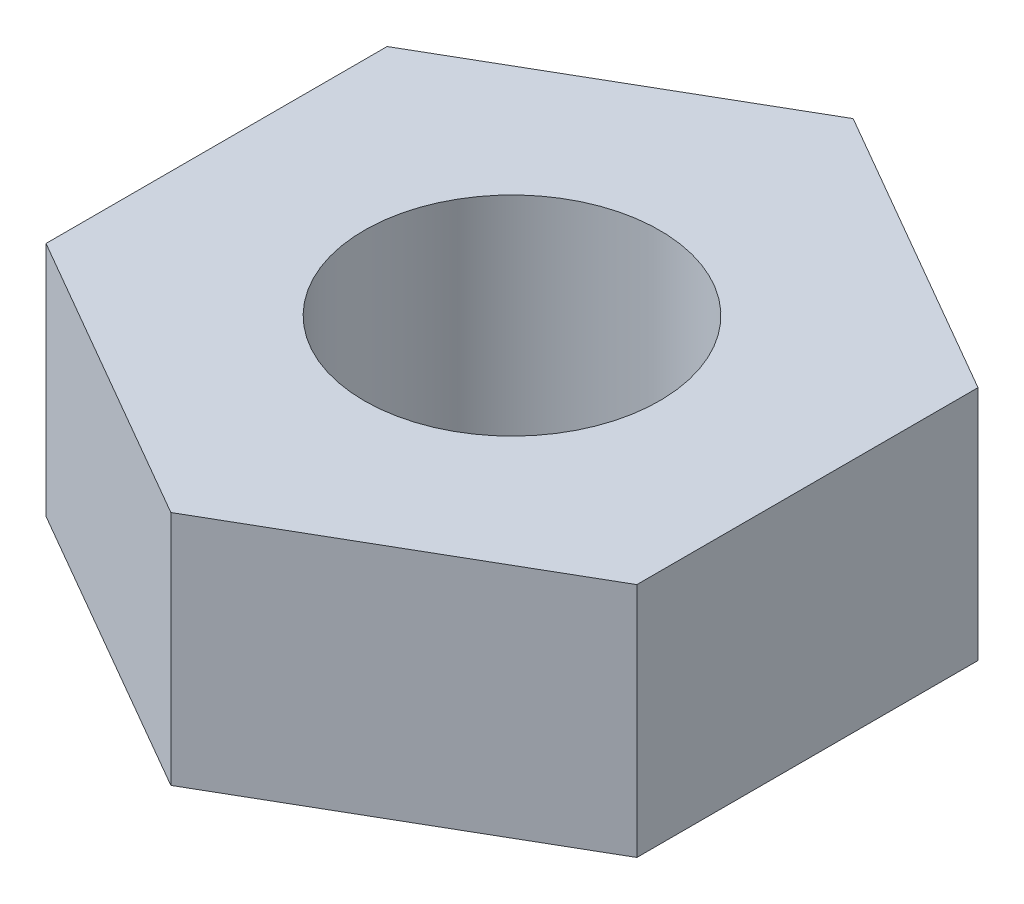
ISO-10303-21;
HEADER;
FILE_DESCRIPTION(('STEP AP214'),'2;1');
FILE_NAME('part.step','',(''),(''),'','','');
FILE_SCHEMA(('AUTOMOTIVE_DESIGN { 1 0 10303 214 1 1 1 1 }'));
ENDSEC;
DATA;
#1=APPLICATION_CONTEXT('core data for automotive mechanical design processes');
#2=APPLICATION_PROTOCOL_DEFINITION('international standard','automotive_design',2000,#1);
#3=PRODUCT_CONTEXT('',#1,'mechanical');
#4=PRODUCT('Part','Part','',(#3));
#5=PRODUCT_RELATED_PRODUCT_CATEGORY('part','',(#4));
#6=PRODUCT_DEFINITION_FORMATION('','',#4);
#7=PRODUCT_DEFINITION_CONTEXT('part definition',#1,'design');
#8=PRODUCT_DEFINITION('design','',#6,#7);
#9=PRODUCT_DEFINITION_SHAPE('','',#8);
#10=(LENGTH_UNIT() NAMED_UNIT(*) SI_UNIT(.MILLI.,.METRE.));
#11=(NAMED_UNIT(*) PLANE_ANGLE_UNIT() SI_UNIT($,.RADIAN.));
#12=(NAMED_UNIT(*) SI_UNIT($,.STERADIAN.) SOLID_ANGLE_UNIT());
#13=UNCERTAINTY_MEASURE_WITH_UNIT(LENGTH_MEASURE(1.E-05),#10,'distance_accuracy_value','');
#14=(GEOMETRIC_REPRESENTATION_CONTEXT(3) GLOBAL_UNCERTAINTY_ASSIGNED_CONTEXT((#13)) GLOBAL_UNIT_ASSIGNED_CONTEXT((#10,
#11,#12)) REPRESENTATION_CONTEXT('',''));
#15=CARTESIAN_POINT('',(0.,0.,0.));
#16=DIRECTION('',(0.,0.,1.));
#17=DIRECTION('',(1.,0.,0.));
#18=AXIS2_PLACEMENT_3D('',#15,#16,#17);
#19=CARTESIAN_POINT('',(0.,1.6,0.));
#20=DIRECTION('',(0.,1.,0.));
#21=DIRECTION('',(0.,0.,1.));
#22=AXIS2_PLACEMENT_3D('',#19,#20,#21);
#23=PLANE('',#22);
#24=DIRECTION('',(0.866025403784438,0.,-0.5));
#25=VECTOR('',#24,1.);
#26=CARTESIAN_POINT('',(0.,1.6,2.3094010767585));
#27=LINE('',#26,#25);
#28=CARTESIAN_POINT('',(0.,1.6,2.3094010767585));
#29=VERTEX_POINT('',#28);
#30=CARTESIAN_POINT('',(2.,1.6,1.15470053837925));
#31=VERTEX_POINT('',#30);
#32=EDGE_CURVE('E150',#29,#31,#27,.T.);
#33=ORIENTED_EDGE('',*,*,#32,.T.);
#34=DIRECTION('',(0.,0.,-1.));
#35=VECTOR('',#34,1.);
#36=CARTESIAN_POINT('',(2.,1.6,1.15470053837925));
#37=LINE('',#36,#35);
#38=CARTESIAN_POINT('',(2.,1.6,-1.15470053837925));
#39=VERTEX_POINT('',#38);
#40=EDGE_CURVE('E98',#31,#39,#37,.T.);
#41=ORIENTED_EDGE('',*,*,#40,.T.);
#42=DIRECTION('',(-0.866025403784439,0.,-0.5));
#43=VECTOR('',#42,1.);
#44=CARTESIAN_POINT('',(2.,1.6,-1.15470053837925));
#45=LINE('',#44,#43);
#46=CARTESIAN_POINT('',(0.,1.6,-2.3094010767585));
#47=VERTEX_POINT('',#46);
#48=EDGE_CURVE('E111',#39,#47,#45,.T.);
#49=ORIENTED_EDGE('',*,*,#48,.T.);
#50=DIRECTION('',(-0.866025403784439,0.,0.5));
#51=VECTOR('',#50,1.);
#52=CARTESIAN_POINT('',(0.,1.6,-2.3094010767585));
#53=LINE('',#52,#51);
#54=CARTESIAN_POINT('',(-2.,1.6,-1.15470053837925));
#55=VERTEX_POINT('',#54);
#56=EDGE_CURVE('E105',#47,#55,#53,.T.);
#57=ORIENTED_EDGE('',*,*,#56,.T.);
#58=DIRECTION('',(0.,0.,1.));
#59=VECTOR('',#58,1.);
#60=CARTESIAN_POINT('',(-2.,1.6,-1.15470053837925));
#61=LINE('',#60,#59);
#62=CARTESIAN_POINT('',(-2.,1.6,1.15470053837925));
#63=VERTEX_POINT('',#62);
#64=EDGE_CURVE('E109',#55,#63,#61,.T.);
#65=ORIENTED_EDGE('',*,*,#64,.T.);
#66=DIRECTION('',(0.866025403784439,0.,0.5));
#67=VECTOR('',#66,1.);
#68=CARTESIAN_POINT('',(-2.,1.6,1.15470053837925));
#69=LINE('',#68,#67);
#70=EDGE_CURVE('E61',#63,#29,#69,.T.);
#71=ORIENTED_EDGE('',*,*,#70,.T.);
#72=EDGE_LOOP('',(#33,#41,#49,#57,#65,#71));
#73=FACE_BOUND('',#72,.T.);
#74=CARTESIAN_POINT('',(0.,1.6,0.));
#75=DIRECTION('',(0.,1.,0.));
#76=DIRECTION('',(0.,0.,1.));
#77=AXIS2_PLACEMENT_3D('',#74,#75,#76);
#78=CIRCLE('',#77,1.);
#79=CARTESIAN_POINT('',(0.,1.6,1.));
#80=VERTEX_POINT('',#79);
#81=EDGE_CURVE('E138',#80,#80,#78,.T.);
#82=ORIENTED_EDGE('',*,*,#81,.F.);
#83=EDGE_LOOP('',(#82));
#84=FACE_BOUND('',#83,.T.);
#85=ADVANCED_FACE('F43',(#73,#84),#23,.T.);
#86=CARTESIAN_POINT('',(0.,0.,0.));
#87=DIRECTION('',(0.,1.,0.));
#88=DIRECTION('',(0.,0.,1.));
#89=AXIS2_PLACEMENT_3D('',#86,#87,#88);
#90=PLANE('',#89);
#91=DIRECTION('',(0.866025403784438,0.,-0.5));
#92=VECTOR('',#91,1.);
#93=CARTESIAN_POINT('',(0.,0.,2.3094010767585));
#94=LINE('',#93,#92);
#95=CARTESIAN_POINT('',(0.,0.,2.3094010767585));
#96=VERTEX_POINT('',#95);
#97=CARTESIAN_POINT('',(2.,0.,1.15470053837925));
#98=VERTEX_POINT('',#97);
#99=EDGE_CURVE('E133',#96,#98,#94,.T.);
#100=ORIENTED_EDGE('',*,*,#99,.F.);
#101=DIRECTION('',(0.866025403784439,0.,0.5));
#102=VECTOR('',#101,1.);
#103=CARTESIAN_POINT('',(-2.,0.,1.15470053837925));
#104=LINE('',#103,#102);
#105=CARTESIAN_POINT('',(-2.,0.,1.15470053837925));
#106=VERTEX_POINT('',#105);
#107=EDGE_CURVE('E90',#106,#96,#104,.T.);
#108=ORIENTED_EDGE('',*,*,#107,.F.);
#109=DIRECTION('',(0.,0.,1.));
#110=VECTOR('',#109,1.);
#111=CARTESIAN_POINT('',(-2.,0.,-1.15470053837925));
#112=LINE('',#111,#110);
#113=CARTESIAN_POINT('',(-2.,0.,-1.15470053837925));
#114=VERTEX_POINT('',#113);
#115=EDGE_CURVE('E84',#114,#106,#112,.T.);
#116=ORIENTED_EDGE('',*,*,#115,.F.);
#117=DIRECTION('',(-0.866025403784439,0.,0.5));
#118=VECTOR('',#117,1.);
#119=CARTESIAN_POINT('',(0.,0.,-2.3094010767585));
#120=LINE('',#119,#118);
#121=CARTESIAN_POINT('',(0.,0.,-2.3094010767585));
#122=VERTEX_POINT('',#121);
#123=EDGE_CURVE('E120',#122,#114,#120,.T.);
#124=ORIENTED_EDGE('',*,*,#123,.F.);
#125=DIRECTION('',(-0.866025403784439,0.,-0.5));
#126=VECTOR('',#125,1.);
#127=CARTESIAN_POINT('',(2.,0.,-1.15470053837925));
#128=LINE('',#127,#126);
#129=CARTESIAN_POINT('',(2.,0.,-1.15470053837925));
#130=VERTEX_POINT('',#129);
#131=EDGE_CURVE('E141',#130,#122,#128,.T.);
#132=ORIENTED_EDGE('',*,*,#131,.F.);
#133=DIRECTION('',(0.,0.,-1.));
#134=VECTOR('',#133,1.);
#135=CARTESIAN_POINT('',(2.,0.,1.15470053837925));
#136=LINE('',#135,#134);
#137=EDGE_CURVE('E137',#98,#130,#136,.T.);
#138=ORIENTED_EDGE('',*,*,#137,.F.);
#139=EDGE_LOOP('',(#100,#108,#116,#124,#132,#138));
#140=FACE_BOUND('',#139,.T.);
#141=CARTESIAN_POINT('',(0.,0.,0.));
#142=DIRECTION('',(0.,1.,0.));
#143=DIRECTION('',(0.,0.,1.));
#144=AXIS2_PLACEMENT_3D('',#141,#142,#143);
#145=CIRCLE('',#144,1.);
#146=CARTESIAN_POINT('',(0.,0.,1.));
#147=VERTEX_POINT('',#146);
#148=EDGE_CURVE('E265',#147,#147,#145,.T.);
#149=ORIENTED_EDGE('',*,*,#148,.T.);
#150=EDGE_LOOP('',(#149));
#151=FACE_BOUND('',#150,.T.);
#152=ADVANCED_FACE('F163',(#140,#151),#90,.F.);
#153=CARTESIAN_POINT('',(0.,1.6,2.3094010767585));
#154=DIRECTION('',(-0.5,0.,-0.866025403784438));
#155=DIRECTION('',(-0.866025403784439,0.,0.5));
#156=AXIS2_PLACEMENT_3D('',#153,#154,#155);
#157=PLANE('',#156);
#158=ORIENTED_EDGE('',*,*,#99,.T.);
#159=DIRECTION('',(0.,-1.,0.));
#160=VECTOR('',#159,1.);
#161=CARTESIAN_POINT('',(2.,1.6,1.15470053837925));
#162=LINE('',#161,#160);
#163=EDGE_CURVE('E11',#31,#98,#162,.T.);
#164=ORIENTED_EDGE('',*,*,#163,.F.);
#165=ORIENTED_EDGE('',*,*,#32,.F.);
#166=DIRECTION('',(0.,-1.,0.));
#167=VECTOR('',#166,1.);
#168=CARTESIAN_POINT('',(0.,1.6,2.3094010767585));
#169=LINE('',#168,#167);
#170=EDGE_CURVE('E129',#29,#96,#169,.T.);
#171=ORIENTED_EDGE('',*,*,#170,.T.);
#172=EDGE_LOOP('',(#158,#164,#165,#171));
#173=FACE_BOUND('',#172,.T.);
#174=ADVANCED_FACE('F45',(#173),#157,.F.);
#175=CARTESIAN_POINT('',(2.,1.6,1.15470053837925));
#176=DIRECTION('',(-1.,0.,0.));
#177=DIRECTION('',(0.,0.,1.));
#178=AXIS2_PLACEMENT_3D('',#175,#176,#177);
#179=PLANE('',#178);
#180=ORIENTED_EDGE('',*,*,#137,.T.);
#181=DIRECTION('',(0.,-1.,0.));
#182=VECTOR('',#181,1.);
#183=CARTESIAN_POINT('',(2.,1.6,-1.15470053837925));
#184=LINE('',#183,#182);
#185=EDGE_CURVE('E53',#39,#130,#184,.T.);
#186=ORIENTED_EDGE('',*,*,#185,.F.);
#187=ORIENTED_EDGE('',*,*,#40,.F.);
#188=ORIENTED_EDGE('',*,*,#163,.T.);
#189=EDGE_LOOP('',(#180,#186,#187,#188));
#190=FACE_BOUND('',#189,.T.);
#191=ADVANCED_FACE('F188',(#190),#179,.F.);
#192=CARTESIAN_POINT('',(2.,1.6,-1.15470053837925));
#193=DIRECTION('',(-0.5,0.,0.866025403784439));
#194=DIRECTION('',(0.866025403784439,0.,0.5));
#195=AXIS2_PLACEMENT_3D('',#192,#193,#194);
#196=PLANE('',#195);
#197=ORIENTED_EDGE('',*,*,#131,.T.);
#198=DIRECTION('',(0.,-1.,0.));
#199=VECTOR('',#198,1.);
#200=CARTESIAN_POINT('',(0.,1.6,-2.3094010767585));
#201=LINE('',#200,#199);
#202=EDGE_CURVE('E122',#47,#122,#201,.T.);
#203=ORIENTED_EDGE('',*,*,#202,.F.);
#204=ORIENTED_EDGE('',*,*,#48,.F.);
#205=ORIENTED_EDGE('',*,*,#185,.T.);
#206=EDGE_LOOP('',(#197,#203,#204,#205));
#207=FACE_BOUND('',#206,.T.);
#208=ADVANCED_FACE('F160',(#207),#196,.F.);
#209=CARTESIAN_POINT('',(0.,1.6,-2.3094010767585));
#210=DIRECTION('',(0.5,0.,0.866025403784439));
#211=DIRECTION('',(0.866025403784439,0.,-0.5));
#212=AXIS2_PLACEMENT_3D('',#209,#210,#211);
#213=PLANE('',#212);
#214=ORIENTED_EDGE('',*,*,#123,.T.);
#215=DIRECTION('',(0.,-1.,0.));
#216=VECTOR('',#215,1.);
#217=CARTESIAN_POINT('',(-2.,1.6,-1.15470053837925));
#218=LINE('',#217,#216);
#219=EDGE_CURVE('E117',#55,#114,#218,.T.);
#220=ORIENTED_EDGE('',*,*,#219,.F.);
#221=ORIENTED_EDGE('',*,*,#56,.F.);
#222=ORIENTED_EDGE('',*,*,#202,.T.);
#223=EDGE_LOOP('',(#214,#220,#221,#222));
#224=FACE_BOUND('',#223,.T.);
#225=ADVANCED_FACE('F118',(#224),#213,.F.);
#226=CARTESIAN_POINT('',(-2.,1.6,-1.15470053837925));
#227=DIRECTION('',(1.,0.,0.));
#228=DIRECTION('',(0.,0.,-1.));
#229=AXIS2_PLACEMENT_3D('',#226,#227,#228);
#230=PLANE('',#229);
#231=ORIENTED_EDGE('',*,*,#115,.T.);
#232=DIRECTION('',(0.,-1.,0.));
#233=VECTOR('',#232,1.);
#234=CARTESIAN_POINT('',(-2.,1.6,1.15470053837925));
#235=LINE('',#234,#233);
#236=EDGE_CURVE('E123',#63,#106,#235,.T.);
#237=ORIENTED_EDGE('',*,*,#236,.F.);
#238=ORIENTED_EDGE('',*,*,#64,.F.);
#239=ORIENTED_EDGE('',*,*,#219,.T.);
#240=EDGE_LOOP('',(#231,#237,#238,#239));
#241=FACE_BOUND('',#240,.T.);
#242=ADVANCED_FACE('F125',(#241),#230,.F.);
#243=CARTESIAN_POINT('',(-2.,1.6,1.15470053837925));
#244=DIRECTION('',(0.5,0.,-0.866025403784439));
#245=DIRECTION('',(-0.866025403784439,0.,-0.5));
#246=AXIS2_PLACEMENT_3D('',#243,#244,#245);
#247=PLANE('',#246);
#248=ORIENTED_EDGE('',*,*,#107,.T.);
#249=ORIENTED_EDGE('',*,*,#170,.F.);
#250=ORIENTED_EDGE('',*,*,#70,.F.);
#251=ORIENTED_EDGE('',*,*,#236,.T.);
#252=EDGE_LOOP('',(#248,#249,#250,#251));
#253=FACE_BOUND('',#252,.T.);
#254=ADVANCED_FACE('F168',(#253),#247,.F.);
#255=CARTESIAN_POINT('',(0.,1.6,0.));
#256=DIRECTION('',(0.,-1.,0.));
#257=DIRECTION('',(0.,0.,-1.));
#258=AXIS2_PLACEMENT_3D('',#255,#256,#257);
#259=CYLINDRICAL_SURFACE('',#258,1.);
#260=ORIENTED_EDGE('',*,*,#81,.T.);
#261=EDGE_LOOP('',(#260));
#262=FACE_BOUND('',#261,.T.);
#263=ORIENTED_EDGE('',*,*,#148,.F.);
#264=EDGE_LOOP('',(#263));
#265=FACE_BOUND('',#264,.T.);
#266=ADVANCED_FACE('F170',(#262,#265),#259,.F.);
#267=CLOSED_SHELL('',(#85,#152,#174,#191,#208,#225,#242,#254,#266));
#268=MANIFOLD_SOLID_BREP('B2',#267);
#269=ADVANCED_BREP_SHAPE_REPRESENTATION('',(#18,#268),#14);
#270=SHAPE_DEFINITION_REPRESENTATION(#9,#269);
ENDSEC;
END-ISO-10303-21;
